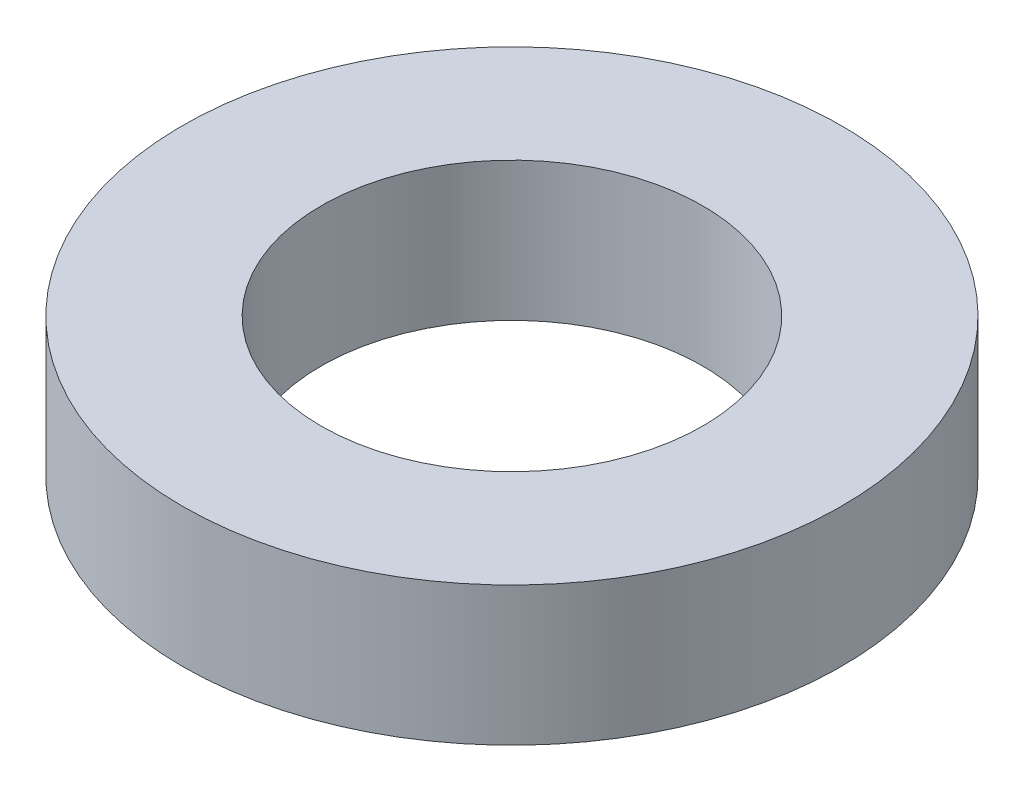
ISO-10303-21;
HEADER;
FILE_DESCRIPTION(('STEP AP214'),'2;1');
FILE_NAME('part.step','',(''),(''),'','','');
FILE_SCHEMA(('AUTOMOTIVE_DESIGN { 1 0 10303 214 1 1 1 1 }'));
ENDSEC;
DATA;
#1=APPLICATION_CONTEXT('core data for automotive mechanical design processes');
#2=APPLICATION_PROTOCOL_DEFINITION('international standard','automotive_design',2000,#1);
#3=PRODUCT_CONTEXT('',#1,'mechanical');
#4=PRODUCT('Part','Part','',(#3));
#5=PRODUCT_RELATED_PRODUCT_CATEGORY('part','',(#4));
#6=PRODUCT_DEFINITION_FORMATION('','',#4);
#7=PRODUCT_DEFINITION_CONTEXT('part definition',#1,'design');
#8=PRODUCT_DEFINITION('design','',#6,#7);
#9=PRODUCT_DEFINITION_SHAPE('','',#8);
#10=(LENGTH_UNIT() NAMED_UNIT(*) SI_UNIT(.MILLI.,.METRE.));
#11=(NAMED_UNIT(*) PLANE_ANGLE_UNIT() SI_UNIT($,.RADIAN.));
#12=(NAMED_UNIT(*) SI_UNIT($,.STERADIAN.) SOLID_ANGLE_UNIT());
#13=UNCERTAINTY_MEASURE_WITH_UNIT(LENGTH_MEASURE(1.E-05),#10,'distance_accuracy_value','');
#14=(GEOMETRIC_REPRESENTATION_CONTEXT(3) GLOBAL_UNCERTAINTY_ASSIGNED_CONTEXT((#13)) GLOBAL_UNIT_ASSIGNED_CONTEXT((#10,
#11,#12)) REPRESENTATION_CONTEXT('',''));
#15=CARTESIAN_POINT('',(0.,0.,0.));
#16=DIRECTION('',(0.,0.,1.));
#17=DIRECTION('',(1.,0.,0.));
#18=AXIS2_PLACEMENT_3D('',#15,#16,#17);
#19=CARTESIAN_POINT('',(0.,20.,0.));
#20=DIRECTION('',(0.,-1.,0.));
#21=DIRECTION('',(0.,0.,-1.));
#22=AXIS2_PLACEMENT_3D('',#19,#20,#21);
#23=CYLINDRICAL_SURFACE('',#22,47.5);
#24=CARTESIAN_POINT('',(0.,20.,0.));
#25=DIRECTION('',(0.,1.,0.));
#26=DIRECTION('',(0.,0.,1.));
#27=AXIS2_PLACEMENT_3D('',#24,#25,#26);
#28=CIRCLE('',#27,47.5);
#29=CARTESIAN_POINT('',(0.,20.,47.5));
#30=VERTEX_POINT('',#29);
#31=EDGE_CURVE('E10',#30,#30,#28,.T.);
#32=ORIENTED_EDGE('',*,*,#31,.F.);
#33=EDGE_LOOP('',(#32));
#34=FACE_BOUND('',#33,.T.);
#35=CARTESIAN_POINT('',(0.,0.,0.));
#36=DIRECTION('',(0.,1.,0.));
#37=DIRECTION('',(0.,0.,1.));
#38=AXIS2_PLACEMENT_3D('',#35,#36,#37);
#39=CIRCLE('',#38,47.5);
#40=CARTESIAN_POINT('',(0.,0.,47.5));
#41=VERTEX_POINT('',#40);
#42=EDGE_CURVE('E37',#41,#41,#39,.T.);
#43=ORIENTED_EDGE('',*,*,#42,.T.);
#44=EDGE_LOOP('',(#43));
#45=FACE_BOUND('',#44,.T.);
#46=ADVANCED_FACE('F40',(#34,#45),#23,.T.);
#47=CARTESIAN_POINT('',(0.,20.,0.));
#48=DIRECTION('',(0.,1.,0.));
#49=DIRECTION('',(0.,0.,1.));
#50=AXIS2_PLACEMENT_3D('',#47,#48,#49);
#51=PLANE('',#50);
#52=CARTESIAN_POINT('',(0.,20.,0.));
#53=DIRECTION('',(0.,1.,0.));
#54=DIRECTION('',(0.,0.,1.));
#55=AXIS2_PLACEMENT_3D('',#52,#53,#54);
#56=CIRCLE('',#55,27.5);
#57=CARTESIAN_POINT('',(0.,20.,27.5));
#58=VERTEX_POINT('',#57);
#59=EDGE_CURVE('E50',#58,#58,#56,.T.);
#60=ORIENTED_EDGE('',*,*,#59,.F.);
#61=EDGE_LOOP('',(#60));
#62=FACE_BOUND('',#61,.T.);
#63=ORIENTED_EDGE('',*,*,#31,.T.);
#64=EDGE_LOOP('',(#63));
#65=FACE_BOUND('',#64,.T.);
#66=ADVANCED_FACE('F59',(#62,#65),#51,.T.);
#67=CARTESIAN_POINT('',(0.,0.,0.));
#68=DIRECTION('',(0.,1.,0.));
#69=DIRECTION('',(0.,0.,1.));
#70=AXIS2_PLACEMENT_3D('',#67,#68,#69);
#71=PLANE('',#70);
#72=CARTESIAN_POINT('',(0.,0.,0.));
#73=DIRECTION('',(0.,1.,0.));
#74=DIRECTION('',(0.,0.,1.));
#75=AXIS2_PLACEMENT_3D('',#72,#73,#74);
#76=CIRCLE('',#75,27.5);
#77=CARTESIAN_POINT('',(0.,0.,27.5));
#78=VERTEX_POINT('',#77);
#79=EDGE_CURVE('E47',#78,#78,#76,.T.);
#80=ORIENTED_EDGE('',*,*,#79,.T.);
#81=EDGE_LOOP('',(#80));
#82=FACE_BOUND('',#81,.T.);
#83=ORIENTED_EDGE('',*,*,#42,.F.);
#84=EDGE_LOOP('',(#83));
#85=FACE_BOUND('',#84,.T.);
#86=ADVANCED_FACE('F58',(#82,#85),#71,.F.);
#87=CARTESIAN_POINT('',(0.,20.,0.));
#88=DIRECTION('',(0.,-1.,0.));
#89=DIRECTION('',(0.,0.,-1.));
#90=AXIS2_PLACEMENT_3D('',#87,#88,#89);
#91=CYLINDRICAL_SURFACE('',#90,27.5);
#92=ORIENTED_EDGE('',*,*,#59,.T.);
#93=EDGE_LOOP('',(#92));
#94=FACE_BOUND('',#93,.T.);
#95=ORIENTED_EDGE('',*,*,#79,.F.);
#96=EDGE_LOOP('',(#95));
#97=FACE_BOUND('',#96,.T.);
#98=ADVANCED_FACE('F54',(#94,#97),#91,.F.);
#99=CLOSED_SHELL('',(#46,#66,#86,#98));
#100=MANIFOLD_SOLID_BREP('B2',#99);
#101=ADVANCED_BREP_SHAPE_REPRESENTATION('',(#18,#100),#14);
#102=SHAPE_DEFINITION_REPRESENTATION(#9,#101);
ENDSEC;
END-ISO-10303-21;
